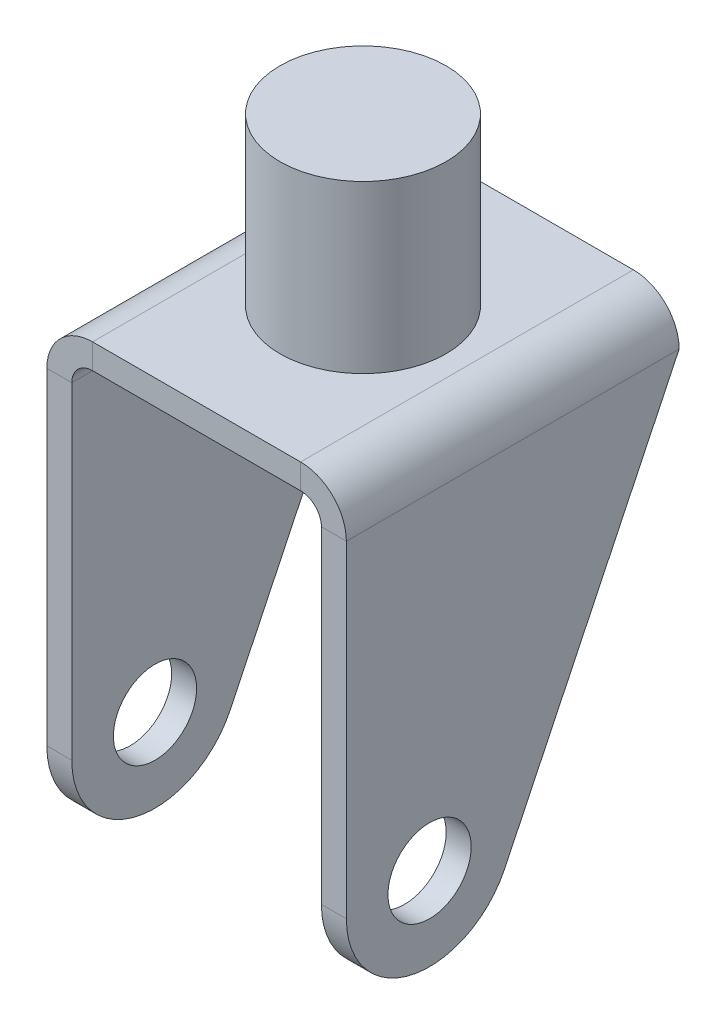
ISO-10303-21;
HEADER;
FILE_DESCRIPTION(('STEP AP214'),'2;1');
FILE_NAME('part.step','',(''),(''),'','','');
FILE_SCHEMA(('AUTOMOTIVE_DESIGN { 1 0 10303 214 1 1 1 1 }'));
ENDSEC;
DATA;
#1=APPLICATION_CONTEXT('core data for automotive mechanical design processes');
#2=APPLICATION_PROTOCOL_DEFINITION('international standard','automotive_design',2000,#1);
#3=PRODUCT_CONTEXT('',#1,'mechanical');
#4=PRODUCT('Part','Part','',(#3));
#5=PRODUCT_RELATED_PRODUCT_CATEGORY('part','',(#4));
#6=PRODUCT_DEFINITION_FORMATION('','',#4);
#7=PRODUCT_DEFINITION_CONTEXT('part definition',#1,'design');
#8=PRODUCT_DEFINITION('design','',#6,#7);
#9=PRODUCT_DEFINITION_SHAPE('','',#8);
#10=(LENGTH_UNIT() NAMED_UNIT(*) SI_UNIT(.MILLI.,.METRE.));
#11=(NAMED_UNIT(*) PLANE_ANGLE_UNIT() SI_UNIT($,.RADIAN.));
#12=(NAMED_UNIT(*) SI_UNIT($,.STERADIAN.) SOLID_ANGLE_UNIT());
#13=UNCERTAINTY_MEASURE_WITH_UNIT(LENGTH_MEASURE(1.E-05),#10,'distance_accuracy_value','');
#14=(GEOMETRIC_REPRESENTATION_CONTEXT(3) GLOBAL_UNCERTAINTY_ASSIGNED_CONTEXT((#13)) GLOBAL_UNIT_ASSIGNED_CONTEXT((#10,
#11,#12)) REPRESENTATION_CONTEXT('',''));
#15=CARTESIAN_POINT('',(0.,0.,0.));
#16=DIRECTION('',(0.,0.,1.));
#17=DIRECTION('',(1.,0.,0.));
#18=AXIS2_PLACEMENT_3D('',#15,#16,#17);
#19=CARTESIAN_POINT('',(-31.75,172.212,50.8));
#20=DIRECTION('',(0.,0.,1.));
#21=DIRECTION('',(1.,0.,0.));
#22=AXIS2_PLACEMENT_3D('',#19,#20,#21);
#23=PLANE('',#22);
#24=DIRECTION('',(0.,1.,0.));
#25=VECTOR('',#24,1.);
#26=CARTESIAN_POINT('',(-45.72,0.,50.8));
#27=LINE('',#26,#25);
#28=CARTESIAN_POINT('',(-45.72,58.42,50.8));
#29=VERTEX_POINT('',#28);
#30=CARTESIAN_POINT('',(-45.72,158.242,50.8));
#31=VERTEX_POINT('',#30);
#32=EDGE_CURVE('E230',#29,#31,#27,.T.);
#33=ORIENTED_EDGE('',*,*,#32,.F.);
#34=DIRECTION('',(1.,0.,0.));
#35=VECTOR('',#34,1.);
#36=CARTESIAN_POINT('',(-45.72,58.42,50.8));
#37=LINE('',#36,#35);
#38=CARTESIAN_POINT('',(-38.1,58.42,50.8));
#39=VERTEX_POINT('',#38);
#40=EDGE_CURVE('E241',#29,#39,#37,.T.);
#41=ORIENTED_EDGE('',*,*,#40,.T.);
#42=DIRECTION('',(0.,1.,0.));
#43=VECTOR('',#42,1.);
#44=CARTESIAN_POINT('',(-38.1,0.,50.8));
#45=LINE('',#44,#43);
#46=CARTESIAN_POINT('',(-38.1,158.242,50.8));
#47=VERTEX_POINT('',#46);
#48=EDGE_CURVE('E154',#39,#47,#45,.T.);
#49=ORIENTED_EDGE('',*,*,#48,.T.);
#50=DIRECTION('',(-1.,0.,0.));
#51=VECTOR('',#50,1.);
#52=CARTESIAN_POINT('',(-38.1,158.242,50.8));
#53=LINE('',#52,#51);
#54=EDGE_CURVE('E142',#47,#31,#53,.T.);
#55=ORIENTED_EDGE('',*,*,#54,.T.);
#56=EDGE_LOOP('',(#33,#41,#49,#55));
#57=FACE_BOUND('',#56,.T.);
#58=ADVANCED_FACE('F57',(#57),#23,.T.);
#59=CARTESIAN_POINT('',(38.1,0.,50.8));
#60=DIRECTION('',(1.,0.,0.));
#61=DIRECTION('',(0.,0.,-1.));
#62=AXIS2_PLACEMENT_3D('',#59,#60,#61);
#63=PLANE('',#62);
#64=CARTESIAN_POINT('',(38.1,58.42,25.4));
#65=DIRECTION('',(1.,0.,0.));
#66=DIRECTION('',(0.,0.,-1.));
#67=AXIS2_PLACEMENT_3D('',#64,#65,#66);
#68=CIRCLE('',#67,12.7);
#69=CARTESIAN_POINT('',(38.1,58.42,12.7));
#70=VERTEX_POINT('',#69);
#71=EDGE_CURVE('E179',#70,#70,#68,.T.);
#72=ORIENTED_EDGE('',*,*,#71,.T.);
#73=EDGE_LOOP('',(#72));
#74=FACE_BOUND('',#73,.T.);
#75=CARTESIAN_POINT('',(38.1,58.42,25.4));
#76=DIRECTION('',(1.,0.,0.));
#77=DIRECTION('',(0.,0.,-1.));
#78=AXIS2_PLACEMENT_3D('',#75,#76,#77);
#79=CIRCLE('',#78,25.4);
#80=CARTESIAN_POINT('',(38.1,58.42,50.8));
#81=VERTEX_POINT('',#80);
#82=CARTESIAN_POINT('',(38.1,47.41001851486,2.51025758779989));
#83=VERTEX_POINT('',#82);
#84=EDGE_CURVE('E299',#81,#83,#79,.T.);
#85=ORIENTED_EDGE('',*,*,#84,.F.);
#86=DIRECTION('',(0.,-1.,0.));
#87=VECTOR('',#86,1.);
#88=CARTESIAN_POINT('',(38.1,0.,50.8));
#89=LINE('',#88,#87);
#90=CARTESIAN_POINT('',(38.1,158.242,50.8));
#91=VERTEX_POINT('',#90);
#92=EDGE_CURVE('E190',#91,#81,#89,.T.);
#93=ORIENTED_EDGE('',*,*,#92,.F.);
#94=DIRECTION('',(0.,0.,-1.));
#95=VECTOR('',#94,1.);
#96=CARTESIAN_POINT('',(38.1,158.242,50.8));
#97=LINE('',#96,#95);
#98=CARTESIAN_POINT('',(38.1,158.242,-50.8));
#99=VERTEX_POINT('',#98);
#100=EDGE_CURVE('E171',#91,#99,#97,.T.);
#101=ORIENTED_EDGE('',*,*,#100,.T.);
#102=DIRECTION('',(0.,-0.901170961110241,0.43346383799764));
#103=VECTOR('',#102,1.);
#104=CARTESIAN_POINT('',(38.1,-9.95527077099662,30.1030002912018));
#105=LINE('',#104,#103);
#106=EDGE_CURVE('E295',#99,#83,#105,.T.);
#107=ORIENTED_EDGE('',*,*,#106,.T.);
#108=EDGE_LOOP('',(#85,#93,#101,#107));
#109=FACE_BOUND('',#108,.T.);
#110=ADVANCED_FACE('F313',(#74,#109),#63,.F.);
#111=CARTESIAN_POINT('',(45.72,0.,50.8));
#112=DIRECTION('',(1.,0.,0.));
#113=DIRECTION('',(0.,0.,-1.));
#114=AXIS2_PLACEMENT_3D('',#111,#112,#113);
#115=PLANE('',#114);
#116=CARTESIAN_POINT('',(45.72,58.42,25.4));
#117=DIRECTION('',(1.,0.,0.));
#118=DIRECTION('',(0.,0.,-1.));
#119=AXIS2_PLACEMENT_3D('',#116,#117,#118);
#120=CIRCLE('',#119,12.7);
#121=CARTESIAN_POINT('',(45.72,58.42,12.7));
#122=VERTEX_POINT('',#121);
#123=EDGE_CURVE('E286',#122,#122,#120,.T.);
#124=ORIENTED_EDGE('',*,*,#123,.F.);
#125=EDGE_LOOP('',(#124));
#126=FACE_BOUND('',#125,.T.);
#127=DIRECTION('',(0.,1.,0.));
#128=VECTOR('',#127,1.);
#129=CARTESIAN_POINT('',(45.72,0.,50.8));
#130=LINE('',#129,#128);
#131=CARTESIAN_POINT('',(45.72,158.242,50.8));
#132=VERTEX_POINT('',#131);
#133=CARTESIAN_POINT('',(45.72,58.42,50.8));
#134=VERTEX_POINT('',#133);
#135=EDGE_CURVE('E225',#132,#134,#130,.F.);
#136=ORIENTED_EDGE('',*,*,#135,.T.);
#137=CARTESIAN_POINT('',(45.72,58.42,25.4));
#138=DIRECTION('',(1.,0.,0.));
#139=DIRECTION('',(0.,0.,-1.));
#140=AXIS2_PLACEMENT_3D('',#137,#138,#139);
#141=CIRCLE('',#140,25.4);
#142=CARTESIAN_POINT('',(45.72,47.41001851486,2.51025758779989));
#143=VERTEX_POINT('',#142);
#144=EDGE_CURVE('E73',#134,#143,#141,.T.);
#145=ORIENTED_EDGE('',*,*,#144,.T.);
#146=DIRECTION('',(0.,-0.901170961110241,0.43346383799764));
#147=VECTOR('',#146,1.);
#148=CARTESIAN_POINT('',(45.72,9.88848042254263,20.5581426295383));
#149=LINE('',#148,#147);
#150=CARTESIAN_POINT('',(45.72,158.242,-50.8));
#151=VERTEX_POINT('',#150);
#152=EDGE_CURVE('E280',#151,#143,#149,.T.);
#153=ORIENTED_EDGE('',*,*,#152,.F.);
#154=DIRECTION('',(0.,0.,-1.));
#155=VECTOR('',#154,1.);
#156=CARTESIAN_POINT('',(45.72,158.242,50.8));
#157=LINE('',#156,#155);
#158=EDGE_CURVE('E204',#132,#151,#157,.T.);
#159=ORIENTED_EDGE('',*,*,#158,.F.);
#160=EDGE_LOOP('',(#136,#145,#153,#159));
#161=FACE_BOUND('',#160,.T.);
#162=ADVANCED_FACE('F305',(#126,#161),#115,.T.);
#163=CARTESIAN_POINT('',(-45.72,0.,50.8));
#164=DIRECTION('',(-1.,0.,0.));
#165=DIRECTION('',(0.,-1.,0.));
#166=AXIS2_PLACEMENT_3D('',#163,#164,#165);
#167=PLANE('',#166);
#168=CARTESIAN_POINT('',(-45.72,58.42,25.4));
#169=DIRECTION('',(1.,0.,0.));
#170=DIRECTION('',(0.,0.,-1.));
#171=AXIS2_PLACEMENT_3D('',#168,#169,#170);
#172=CIRCLE('',#171,12.7);
#173=CARTESIAN_POINT('',(-45.72,58.42,12.7));
#174=VERTEX_POINT('',#173);
#175=EDGE_CURVE('E289',#174,#174,#172,.T.);
#176=ORIENTED_EDGE('',*,*,#175,.T.);
#177=EDGE_LOOP('',(#176));
#178=FACE_BOUND('',#177,.T.);
#179=DIRECTION('',(0.,-0.901170961110241,0.43346383799764));
#180=VECTOR('',#179,1.);
#181=CARTESIAN_POINT('',(-45.72,9.88848042254263,20.5581426295383));
#182=LINE('',#181,#180);
#183=CARTESIAN_POINT('',(-45.72,158.242,-50.8));
#184=VERTEX_POINT('',#183);
#185=CARTESIAN_POINT('',(-45.72,47.41001851486,2.51025758779989));
#186=VERTEX_POINT('',#185);
#187=EDGE_CURVE('E275',#184,#186,#182,.T.);
#188=ORIENTED_EDGE('',*,*,#187,.T.);
#189=CARTESIAN_POINT('',(-45.72,58.42,25.4));
#190=DIRECTION('',(1.,0.,0.));
#191=DIRECTION('',(0.,0.,-1.));
#192=AXIS2_PLACEMENT_3D('',#189,#190,#191);
#193=CIRCLE('',#192,25.4);
#194=EDGE_CURVE('E272',#29,#186,#193,.T.);
#195=ORIENTED_EDGE('',*,*,#194,.F.);
#196=ORIENTED_EDGE('',*,*,#32,.T.);
#197=DIRECTION('',(0.,0.,-1.));
#198=VECTOR('',#197,1.);
#199=CARTESIAN_POINT('',(-45.72,158.242,50.8));
#200=LINE('',#199,#198);
#201=EDGE_CURVE('E195',#31,#184,#200,.T.);
#202=ORIENTED_EDGE('',*,*,#201,.T.);
#203=EDGE_LOOP('',(#188,#195,#196,#202));
#204=FACE_BOUND('',#203,.T.);
#205=ADVANCED_FACE('F279',(#178,#204),#167,.T.);
#206=CARTESIAN_POINT('',(-38.1,0.,50.8));
#207=DIRECTION('',(-1.,0.,0.));
#208=DIRECTION('',(0.,-1.,0.));
#209=AXIS2_PLACEMENT_3D('',#206,#207,#208);
#210=PLANE('',#209);
#211=CARTESIAN_POINT('',(-38.1,58.42,25.4));
#212=DIRECTION('',(-1.,0.,0.));
#213=DIRECTION('',(0.,-1.,0.));
#214=AXIS2_PLACEMENT_3D('',#211,#212,#213);
#215=CIRCLE('',#214,12.7);
#216=CARTESIAN_POINT('',(-38.1,45.72,25.4));
#217=VERTEX_POINT('',#216);
#218=EDGE_CURVE('E61',#217,#217,#215,.T.);
#219=ORIENTED_EDGE('',*,*,#218,.T.);
#220=EDGE_LOOP('',(#219));
#221=FACE_BOUND('',#220,.T.);
#222=CARTESIAN_POINT('',(-38.1,58.42,25.4));
#223=DIRECTION('',(-1.,0.,0.));
#224=DIRECTION('',(0.,-1.,0.));
#225=AXIS2_PLACEMENT_3D('',#222,#223,#224);
#226=CIRCLE('',#225,25.4);
#227=CARTESIAN_POINT('',(-38.1,47.41001851486,2.51025758779989));
#228=VERTEX_POINT('',#227);
#229=EDGE_CURVE('E248',#228,#39,#226,.T.);
#230=ORIENTED_EDGE('',*,*,#229,.F.);
#231=DIRECTION('',(0.,0.901170961110241,-0.43346383799764));
#232=VECTOR('',#231,1.);
#233=CARTESIAN_POINT('',(-38.1,-9.95527077099662,30.1030002912018));
#234=LINE('',#233,#232);
#235=CARTESIAN_POINT('',(-38.1,158.242,-50.8));
#236=VERTEX_POINT('',#235);
#237=EDGE_CURVE('E292',#228,#236,#234,.T.);
#238=ORIENTED_EDGE('',*,*,#237,.T.);
#239=DIRECTION('',(0.,0.,-1.));
#240=VECTOR('',#239,1.);
#241=CARTESIAN_POINT('',(-38.1,158.242,50.8));
#242=LINE('',#241,#240);
#243=EDGE_CURVE('E163',#47,#236,#242,.T.);
#244=ORIENTED_EDGE('',*,*,#243,.F.);
#245=ORIENTED_EDGE('',*,*,#48,.F.);
#246=EDGE_LOOP('',(#230,#238,#244,#245));
#247=FACE_BOUND('',#246,.T.);
#248=ADVANCED_FACE('F244',(#221,#247),#210,.F.);
#249=CARTESIAN_POINT('',(31.75,158.242,50.8));
#250=DIRECTION('',(0.,0.,1.));
#251=DIRECTION('',(1.,0.,0.));
#252=AXIS2_PLACEMENT_3D('',#249,#250,#251);
#253=PLANE('',#252);
#254=ORIENTED_EDGE('',*,*,#92,.T.);
#255=DIRECTION('',(1.,0.,0.));
#256=VECTOR('',#255,1.);
#257=CARTESIAN_POINT('',(-45.72,58.42,50.8));
#258=LINE('',#257,#256);
#259=EDGE_CURVE('E12',#81,#134,#258,.T.);
#260=ORIENTED_EDGE('',*,*,#259,.T.);
#261=ORIENTED_EDGE('',*,*,#135,.F.);
#262=DIRECTION('',(-1.,0.,0.));
#263=VECTOR('',#262,1.);
#264=CARTESIAN_POINT('',(45.72,158.242,50.8));
#265=LINE('',#264,#263);
#266=EDGE_CURVE('E81',#132,#91,#265,.T.);
#267=ORIENTED_EDGE('',*,*,#266,.T.);
#268=EDGE_LOOP('',(#254,#260,#261,#267));
#269=FACE_BOUND('',#268,.T.);
#270=ADVANCED_FACE('F307',(#269),#253,.T.);
#271=CARTESIAN_POINT('',(31.75,164.592,50.8));
#272=DIRECTION('',(0.,0.,1.));
#273=DIRECTION('',(1.,0.,0.));
#274=AXIS2_PLACEMENT_3D('',#271,#272,#273);
#275=PLANE('',#274);
#276=DIRECTION('',(0.,1.,0.));
#277=VECTOR('',#276,1.);
#278=CARTESIAN_POINT('',(31.75,164.592,50.8));
#279=LINE('',#278,#277);
#280=CARTESIAN_POINT('',(31.75,164.592,50.8));
#281=VERTEX_POINT('',#280);
#282=CARTESIAN_POINT('',(31.75,172.212,50.8));
#283=VERTEX_POINT('',#282);
#284=EDGE_CURVE('E66',#281,#283,#279,.T.);
#285=ORIENTED_EDGE('',*,*,#284,.F.);
#286=CARTESIAN_POINT('',(31.75,158.242,50.8));
#287=DIRECTION('',(0.,0.,-1.));
#288=DIRECTION('',(-1.,0.,0.));
#289=AXIS2_PLACEMENT_3D('',#286,#287,#288);
#290=CIRCLE('',#289,6.35);
#291=EDGE_CURVE('E169',#281,#91,#290,.T.);
#292=ORIENTED_EDGE('',*,*,#291,.T.);
#293=ORIENTED_EDGE('',*,*,#266,.F.);
#294=CARTESIAN_POINT('',(31.75,158.242,50.8));
#295=DIRECTION('',(0.,0.,1.));
#296=DIRECTION('',(1.,0.,0.));
#297=AXIS2_PLACEMENT_3D('',#294,#295,#296);
#298=CIRCLE('',#297,13.97);
#299=EDGE_CURVE('E222',#283,#132,#298,.F.);
#300=ORIENTED_EDGE('',*,*,#299,.F.);
#301=EDGE_LOOP('',(#285,#292,#293,#300));
#302=FACE_BOUND('',#301,.T.);
#303=ADVANCED_FACE('F59',(#302),#275,.T.);
#304=CARTESIAN_POINT('',(45.72,158.242,50.8));
#305=DIRECTION('',(0.,0.,1.));
#306=DIRECTION('',(1.,0.,0.));
#307=AXIS2_PLACEMENT_3D('',#304,#305,#306);
#308=PLANE('',#307);
#309=DIRECTION('',(1.,0.,0.));
#310=VECTOR('',#309,1.);
#311=CARTESIAN_POINT('',(38.1,164.592,50.8));
#312=LINE('',#311,#310);
#313=CARTESIAN_POINT('',(-31.75,164.592,50.8));
#314=VERTEX_POINT('',#313);
#315=EDGE_CURVE('E134',#314,#281,#312,.T.);
#316=ORIENTED_EDGE('',*,*,#315,.T.);
#317=ORIENTED_EDGE('',*,*,#284,.T.);
#318=DIRECTION('',(1.,0.,0.));
#319=VECTOR('',#318,1.);
#320=CARTESIAN_POINT('',(38.1,172.212,50.8));
#321=LINE('',#320,#319);
#322=CARTESIAN_POINT('',(-31.75,172.212,50.8));
#323=VERTEX_POINT('',#322);
#324=EDGE_CURVE('E137',#323,#283,#321,.T.);
#325=ORIENTED_EDGE('',*,*,#324,.F.);
#326=DIRECTION('',(0.,-1.,0.));
#327=VECTOR('',#326,1.);
#328=CARTESIAN_POINT('',(-31.75,172.212,50.8));
#329=LINE('',#328,#327);
#330=EDGE_CURVE('E130',#323,#314,#329,.T.);
#331=ORIENTED_EDGE('',*,*,#330,.T.);
#332=EDGE_LOOP('',(#316,#317,#325,#331));
#333=FACE_BOUND('',#332,.T.);
#334=ADVANCED_FACE('F132',(#333),#308,.T.);
#335=CARTESIAN_POINT('',(38.1,158.242,-50.8));
#336=DIRECTION('',(0.,0.,-1.));
#337=DIRECTION('',(-1.,0.,0.));
#338=AXIS2_PLACEMENT_3D('',#335,#336,#337);
#339=PLANE('',#338);
#340=DIRECTION('',(1.,0.,0.));
#341=VECTOR('',#340,1.);
#342=CARTESIAN_POINT('',(38.1,158.242,-50.8));
#343=LINE('',#342,#341);
#344=EDGE_CURVE('E213',#99,#151,#343,.T.);
#345=ORIENTED_EDGE('',*,*,#344,.F.);
#346=CARTESIAN_POINT('',(31.75,158.242,-50.8));
#347=DIRECTION('',(0.,0.,-1.));
#348=DIRECTION('',(-1.,0.,0.));
#349=AXIS2_PLACEMENT_3D('',#346,#347,#348);
#350=CIRCLE('',#349,6.35);
#351=CARTESIAN_POINT('',(31.75,164.592,-50.8));
#352=VERTEX_POINT('',#351);
#353=EDGE_CURVE('E187',#352,#99,#350,.T.);
#354=ORIENTED_EDGE('',*,*,#353,.F.);
#355=DIRECTION('',(0.,-1.,0.));
#356=VECTOR('',#355,1.);
#357=CARTESIAN_POINT('',(31.75,172.212,-50.8));
#358=LINE('',#357,#356);
#359=CARTESIAN_POINT('',(31.75,172.212,-50.8));
#360=VERTEX_POINT('',#359);
#361=EDGE_CURVE('E106',#360,#352,#358,.T.);
#362=ORIENTED_EDGE('',*,*,#361,.F.);
#363=CARTESIAN_POINT('',(31.75,158.242,-50.8));
#364=DIRECTION('',(0.,0.,1.));
#365=DIRECTION('',(1.,0.,0.));
#366=AXIS2_PLACEMENT_3D('',#363,#364,#365);
#367=CIRCLE('',#366,13.97);
#368=EDGE_CURVE('E175',#360,#151,#367,.F.);
#369=ORIENTED_EDGE('',*,*,#368,.T.);
#370=EDGE_LOOP('',(#345,#354,#362,#369));
#371=FACE_BOUND('',#370,.T.);
#372=ADVANCED_FACE('F320',(#371),#339,.T.);
#373=CARTESIAN_POINT('',(-38.1,158.242,50.8));
#374=DIRECTION('',(0.,0.,1.));
#375=DIRECTION('',(1.,0.,0.));
#376=AXIS2_PLACEMENT_3D('',#373,#374,#375);
#377=PLANE('',#376);
#378=ORIENTED_EDGE('',*,*,#54,.F.);
#379=CARTESIAN_POINT('',(-31.75,158.242,50.8));
#380=DIRECTION('',(0.,0.,-1.));
#381=DIRECTION('',(-1.,0.,0.));
#382=AXIS2_PLACEMENT_3D('',#379,#380,#381);
#383=CIRCLE('',#382,6.35);
#384=EDGE_CURVE('E147',#47,#314,#383,.T.);
#385=ORIENTED_EDGE('',*,*,#384,.T.);
#386=ORIENTED_EDGE('',*,*,#330,.F.);
#387=CARTESIAN_POINT('',(-31.75,158.242,50.8));
#388=DIRECTION('',(0.,0.,1.));
#389=DIRECTION('',(1.,0.,0.));
#390=AXIS2_PLACEMENT_3D('',#387,#388,#389);
#391=CIRCLE('',#390,13.97);
#392=EDGE_CURVE('E228',#31,#323,#391,.F.);
#393=ORIENTED_EDGE('',*,*,#392,.F.);
#394=EDGE_LOOP('',(#378,#385,#386,#393));
#395=FACE_BOUND('',#394,.T.);
#396=ADVANCED_FACE('F149',(#395),#377,.T.);
#397=CARTESIAN_POINT('',(-31.75,164.592,-50.8));
#398=DIRECTION('',(0.,0.,-1.));
#399=DIRECTION('',(-1.,0.,0.));
#400=AXIS2_PLACEMENT_3D('',#397,#398,#399);
#401=PLANE('',#400);
#402=DIRECTION('',(0.,1.,0.));
#403=VECTOR('',#402,1.);
#404=CARTESIAN_POINT('',(-31.75,164.592,-50.8));
#405=LINE('',#404,#403);
#406=CARTESIAN_POINT('',(-31.75,164.592,-50.8));
#407=VERTEX_POINT('',#406);
#408=CARTESIAN_POINT('',(-31.75,172.212,-50.8));
#409=VERTEX_POINT('',#408);
#410=EDGE_CURVE('E143',#407,#409,#405,.T.);
#411=ORIENTED_EDGE('',*,*,#410,.F.);
#412=CARTESIAN_POINT('',(-31.75,158.242,-50.8));
#413=DIRECTION('',(0.,0.,-1.));
#414=DIRECTION('',(-1.,0.,0.));
#415=AXIS2_PLACEMENT_3D('',#412,#413,#414);
#416=CIRCLE('',#415,6.35);
#417=EDGE_CURVE('E161',#236,#407,#416,.T.);
#418=ORIENTED_EDGE('',*,*,#417,.F.);
#419=DIRECTION('',(1.,0.,0.));
#420=VECTOR('',#419,1.);
#421=CARTESIAN_POINT('',(-45.72,158.242,-50.8));
#422=LINE('',#421,#420);
#423=EDGE_CURVE('E207',#184,#236,#422,.T.);
#424=ORIENTED_EDGE('',*,*,#423,.F.);
#425=CARTESIAN_POINT('',(-31.75,158.242,-50.8));
#426=DIRECTION('',(0.,0.,1.));
#427=DIRECTION('',(1.,0.,0.));
#428=AXIS2_PLACEMENT_3D('',#425,#426,#427);
#429=CIRCLE('',#428,13.97);
#430=EDGE_CURVE('E181',#184,#409,#429,.F.);
#431=ORIENTED_EDGE('',*,*,#430,.T.);
#432=EDGE_LOOP('',(#411,#418,#424,#431));
#433=FACE_BOUND('',#432,.T.);
#434=ADVANCED_FACE('F343',(#433),#401,.T.);
#435=CARTESIAN_POINT('',(-45.72,158.242,-50.8));
#436=DIRECTION('',(0.,0.,-1.));
#437=DIRECTION('',(-1.,0.,0.));
#438=AXIS2_PLACEMENT_3D('',#435,#436,#437);
#439=PLANE('',#438);
#440=DIRECTION('',(1.,0.,0.));
#441=VECTOR('',#440,1.);
#442=CARTESIAN_POINT('',(38.1,164.592,-50.8));
#443=LINE('',#442,#441);
#444=EDGE_CURVE('E185',#407,#352,#443,.T.);
#445=ORIENTED_EDGE('',*,*,#444,.F.);
#446=ORIENTED_EDGE('',*,*,#410,.T.);
#447=DIRECTION('',(1.,0.,0.));
#448=VECTOR('',#447,1.);
#449=CARTESIAN_POINT('',(38.1,172.212,-50.8));
#450=LINE('',#449,#448);
#451=EDGE_CURVE('E178',#409,#360,#450,.T.);
#452=ORIENTED_EDGE('',*,*,#451,.T.);
#453=ORIENTED_EDGE('',*,*,#361,.T.);
#454=EDGE_LOOP('',(#445,#446,#452,#453));
#455=FACE_BOUND('',#454,.T.);
#456=ADVANCED_FACE('F452',(#455),#439,.T.);
#457=CARTESIAN_POINT('',(31.75,158.242,50.8));
#458=DIRECTION('',(0.,0.,-1.));
#459=DIRECTION('',(-1.,0.,0.));
#460=AXIS2_PLACEMENT_3D('',#457,#458,#459);
#461=CYLINDRICAL_SURFACE('',#460,13.97);
#462=ORIENTED_EDGE('',*,*,#368,.F.);
#463=DIRECTION('',(0.,0.,-1.));
#464=VECTOR('',#463,1.);
#465=CARTESIAN_POINT('',(31.75,172.212,50.8));
#466=LINE('',#465,#464);
#467=EDGE_CURVE('E201',#283,#360,#466,.T.);
#468=ORIENTED_EDGE('',*,*,#467,.F.);
#469=ORIENTED_EDGE('',*,*,#299,.T.);
#470=ORIENTED_EDGE('',*,*,#158,.T.);
#471=EDGE_LOOP('',(#462,#468,#469,#470));
#472=FACE_BOUND('',#471,.T.);
#473=ADVANCED_FACE('F221',(#472),#461,.T.);
#474=CARTESIAN_POINT('',(38.1,172.212,50.8));
#475=DIRECTION('',(0.,1.,0.));
#476=DIRECTION('',(0.,0.,1.));
#477=AXIS2_PLACEMENT_3D('',#474,#475,#476);
#478=PLANE('',#477);
#479=CARTESIAN_POINT('',(0.,172.212,0.));
#480=DIRECTION('',(0.,1.,0.));
#481=DIRECTION('',(0.,0.,1.));
#482=AXIS2_PLACEMENT_3D('',#479,#480,#481);
#483=CIRCLE('',#482,25.361825220135);
#484=CARTESIAN_POINT('',(0.,172.212,25.361825220135));
#485=VERTEX_POINT('',#484);
#486=EDGE_CURVE('E381',#485,#485,#483,.T.);
#487=ORIENTED_EDGE('',*,*,#486,.F.);
#488=EDGE_LOOP('',(#487));
#489=FACE_BOUND('',#488,.T.);
#490=ORIENTED_EDGE('',*,*,#451,.F.);
#491=DIRECTION('',(0.,0.,-1.));
#492=VECTOR('',#491,1.);
#493=CARTESIAN_POINT('',(-31.75,172.212,50.8));
#494=LINE('',#493,#492);
#495=EDGE_CURVE('E198',#323,#409,#494,.T.);
#496=ORIENTED_EDGE('',*,*,#495,.F.);
#497=ORIENTED_EDGE('',*,*,#324,.T.);
#498=ORIENTED_EDGE('',*,*,#467,.T.);
#499=EDGE_LOOP('',(#490,#496,#497,#498));
#500=FACE_BOUND('',#499,.T.);
#501=ADVANCED_FACE('F227',(#489,#500),#478,.T.);
#502=CARTESIAN_POINT('',(-31.75,158.242,50.8));
#503=DIRECTION('',(0.,0.,-1.));
#504=DIRECTION('',(-1.,0.,0.));
#505=AXIS2_PLACEMENT_3D('',#502,#503,#504);
#506=CYLINDRICAL_SURFACE('',#505,13.97);
#507=ORIENTED_EDGE('',*,*,#430,.F.);
#508=ORIENTED_EDGE('',*,*,#201,.F.);
#509=ORIENTED_EDGE('',*,*,#392,.T.);
#510=ORIENTED_EDGE('',*,*,#495,.T.);
#511=EDGE_LOOP('',(#507,#508,#509,#510));
#512=FACE_BOUND('',#511,.T.);
#513=ADVANCED_FACE('F418',(#512),#506,.T.);
#514=CARTESIAN_POINT('',(-31.75,158.242,50.8));
#515=DIRECTION('',(0.,0.,-1.));
#516=DIRECTION('',(-1.,0.,0.));
#517=AXIS2_PLACEMENT_3D('',#514,#515,#516);
#518=CYLINDRICAL_SURFACE('',#517,6.35);
#519=ORIENTED_EDGE('',*,*,#417,.T.);
#520=DIRECTION('',(0.,0.,-1.));
#521=VECTOR('',#520,1.);
#522=CARTESIAN_POINT('',(-31.75,164.592,50.8));
#523=LINE('',#522,#521);
#524=EDGE_CURVE('E158',#314,#407,#523,.T.);
#525=ORIENTED_EDGE('',*,*,#524,.F.);
#526=ORIENTED_EDGE('',*,*,#384,.F.);
#527=ORIENTED_EDGE('',*,*,#243,.T.);
#528=EDGE_LOOP('',(#519,#525,#526,#527));
#529=FACE_BOUND('',#528,.T.);
#530=ADVANCED_FACE('F159',(#529),#518,.F.);
#531=CARTESIAN_POINT('',(38.1,164.592,50.8));
#532=DIRECTION('',(0.,1.,0.));
#533=DIRECTION('',(0.,0.,1.));
#534=AXIS2_PLACEMENT_3D('',#531,#532,#533);
#535=PLANE('',#534);
#536=ORIENTED_EDGE('',*,*,#444,.T.);
#537=DIRECTION('',(0.,0.,-1.));
#538=VECTOR('',#537,1.);
#539=CARTESIAN_POINT('',(31.75,164.592,50.8));
#540=LINE('',#539,#538);
#541=EDGE_CURVE('E164',#281,#352,#540,.T.);
#542=ORIENTED_EDGE('',*,*,#541,.F.);
#543=ORIENTED_EDGE('',*,*,#315,.F.);
#544=ORIENTED_EDGE('',*,*,#524,.T.);
#545=EDGE_LOOP('',(#536,#542,#543,#544));
#546=FACE_BOUND('',#545,.T.);
#547=ADVANCED_FACE('F166',(#546),#535,.F.);
#548=CARTESIAN_POINT('',(31.75,158.242,50.8));
#549=DIRECTION('',(0.,0.,-1.));
#550=DIRECTION('',(-1.,0.,0.));
#551=AXIS2_PLACEMENT_3D('',#548,#549,#550);
#552=CYLINDRICAL_SURFACE('',#551,6.35);
#553=ORIENTED_EDGE('',*,*,#353,.T.);
#554=ORIENTED_EDGE('',*,*,#100,.F.);
#555=ORIENTED_EDGE('',*,*,#291,.F.);
#556=ORIENTED_EDGE('',*,*,#541,.T.);
#557=EDGE_LOOP('',(#553,#554,#555,#556));
#558=FACE_BOUND('',#557,.T.);
#559=ADVANCED_FACE('F322',(#558),#552,.F.);
#560=CARTESIAN_POINT('',(-45.72,9.88848042254263,20.5581426295383));
#561=DIRECTION('',(0.,0.43346383799764,0.901170961110241));
#562=DIRECTION('',(0.,-0.901170961110241,0.43346383799764));
#563=AXIS2_PLACEMENT_3D('',#560,#561,#562);
#564=PLANE('',#563);
#565=DIRECTION('',(1.,0.,0.));
#566=VECTOR('',#565,1.);
#567=CARTESIAN_POINT('',(-45.72,47.41001851486,2.51025758779989));
#568=LINE('',#567,#566);
#569=EDGE_CURVE('E291',#186,#228,#568,.T.);
#570=ORIENTED_EDGE('',*,*,#569,.F.);
#571=ORIENTED_EDGE('',*,*,#187,.F.);
#572=ORIENTED_EDGE('',*,*,#423,.T.);
#573=ORIENTED_EDGE('',*,*,#237,.F.);
#574=EDGE_LOOP('',(#570,#571,#572,#573));
#575=FACE_BOUND('',#574,.T.);
#576=ADVANCED_FACE('F324',(#575),#564,.F.);
#577=CARTESIAN_POINT('',(-45.72,58.42,25.4));
#578=DIRECTION('',(1.,0.,0.));
#579=DIRECTION('',(0.,0.,-1.));
#580=AXIS2_PLACEMENT_3D('',#577,#578,#579);
#581=CYLINDRICAL_SURFACE('',#580,25.4);
#582=ORIENTED_EDGE('',*,*,#229,.T.);
#583=ORIENTED_EDGE('',*,*,#40,.F.);
#584=ORIENTED_EDGE('',*,*,#194,.T.);
#585=ORIENTED_EDGE('',*,*,#569,.T.);
#586=EDGE_LOOP('',(#582,#583,#584,#585));
#587=FACE_BOUND('',#586,.T.);
#588=ADVANCED_FACE('F271',(#587),#581,.T.);
#589=ORIENTED_EDGE('',*,*,#84,.T.);
#590=EDGE_CURVE('E274',#83,#143,#568,.T.);
#591=ORIENTED_EDGE('',*,*,#590,.T.);
#592=ORIENTED_EDGE('',*,*,#144,.F.);
#593=ORIENTED_EDGE('',*,*,#259,.F.);
#594=EDGE_LOOP('',(#589,#591,#592,#593));
#595=FACE_BOUND('',#594,.T.);
#596=ADVANCED_FACE('F310',(#595),#581,.T.);
#597=ORIENTED_EDGE('',*,*,#344,.T.);
#598=ORIENTED_EDGE('',*,*,#152,.T.);
#599=ORIENTED_EDGE('',*,*,#590,.F.);
#600=ORIENTED_EDGE('',*,*,#106,.F.);
#601=EDGE_LOOP('',(#597,#598,#599,#600));
#602=FACE_BOUND('',#601,.T.);
#603=ADVANCED_FACE('F317',(#602),#564,.F.);
#604=CARTESIAN_POINT('',(-45.72,58.42,25.4));
#605=DIRECTION('',(1.,0.,0.));
#606=DIRECTION('',(0.,0.,-1.));
#607=AXIS2_PLACEMENT_3D('',#604,#605,#606);
#608=CYLINDRICAL_SURFACE('',#607,12.7);
#609=ORIENTED_EDGE('',*,*,#175,.F.);
#610=EDGE_LOOP('',(#609));
#611=FACE_BOUND('',#610,.T.);
#612=ORIENTED_EDGE('',*,*,#218,.F.);
#613=EDGE_LOOP('',(#612));
#614=FACE_BOUND('',#613,.T.);
#615=ADVANCED_FACE('F364',(#611,#614),#608,.F.);
#616=ORIENTED_EDGE('',*,*,#123,.T.);
#617=EDGE_LOOP('',(#616));
#618=FACE_BOUND('',#617,.T.);
#619=ORIENTED_EDGE('',*,*,#71,.F.);
#620=EDGE_LOOP('',(#619));
#621=FACE_BOUND('',#620,.T.);
#622=ADVANCED_FACE('F365',(#618,#621),#608,.F.);
#623=CARTESIAN_POINT('',(0.,223.012,0.));
#624=DIRECTION('',(0.,-1.,0.));
#625=DIRECTION('',(0.,0.,-1.));
#626=AXIS2_PLACEMENT_3D('',#623,#624,#625);
#627=CYLINDRICAL_SURFACE('',#626,25.361825220135);
#628=CARTESIAN_POINT('',(0.,223.012,0.));
#629=DIRECTION('',(0.,1.,0.));
#630=DIRECTION('',(0.,0.,1.));
#631=AXIS2_PLACEMENT_3D('',#628,#629,#630);
#632=CIRCLE('',#631,25.361825220135);
#633=CARTESIAN_POINT('',(0.,223.012,25.361825220135));
#634=VERTEX_POINT('',#633);
#635=EDGE_CURVE('E380',#634,#634,#632,.T.);
#636=ORIENTED_EDGE('',*,*,#635,.F.);
#637=EDGE_LOOP('',(#636));
#638=FACE_BOUND('',#637,.T.);
#639=ORIENTED_EDGE('',*,*,#486,.T.);
#640=EDGE_LOOP('',(#639));
#641=FACE_BOUND('',#640,.T.);
#642=ADVANCED_FACE('F368',(#638,#641),#627,.T.);
#643=CARTESIAN_POINT('',(0.,223.012,0.));
#644=DIRECTION('',(0.,1.,0.));
#645=DIRECTION('',(0.,0.,1.));
#646=AXIS2_PLACEMENT_3D('',#643,#644,#645);
#647=PLANE('',#646);
#648=ORIENTED_EDGE('',*,*,#635,.T.);
#649=EDGE_LOOP('',(#648));
#650=FACE_BOUND('',#649,.T.);
#651=ADVANCED_FACE('F372',(#650),#647,.T.);
#652=CLOSED_SHELL('',(#58,#110,#162,#205,#248,#270,#303,#334,#372,#396,#434,#456,#473,#501,#513,
#530,#547,#559,#576,#588,#596,#603,#615,#622,#642,#651));
#653=MANIFOLD_SOLID_BREP('B2',#652);
#654=ADVANCED_BREP_SHAPE_REPRESENTATION('',(#18,#653),#14);
#655=SHAPE_DEFINITION_REPRESENTATION(#9,#654);
ENDSEC;
END-ISO-10303-21;
